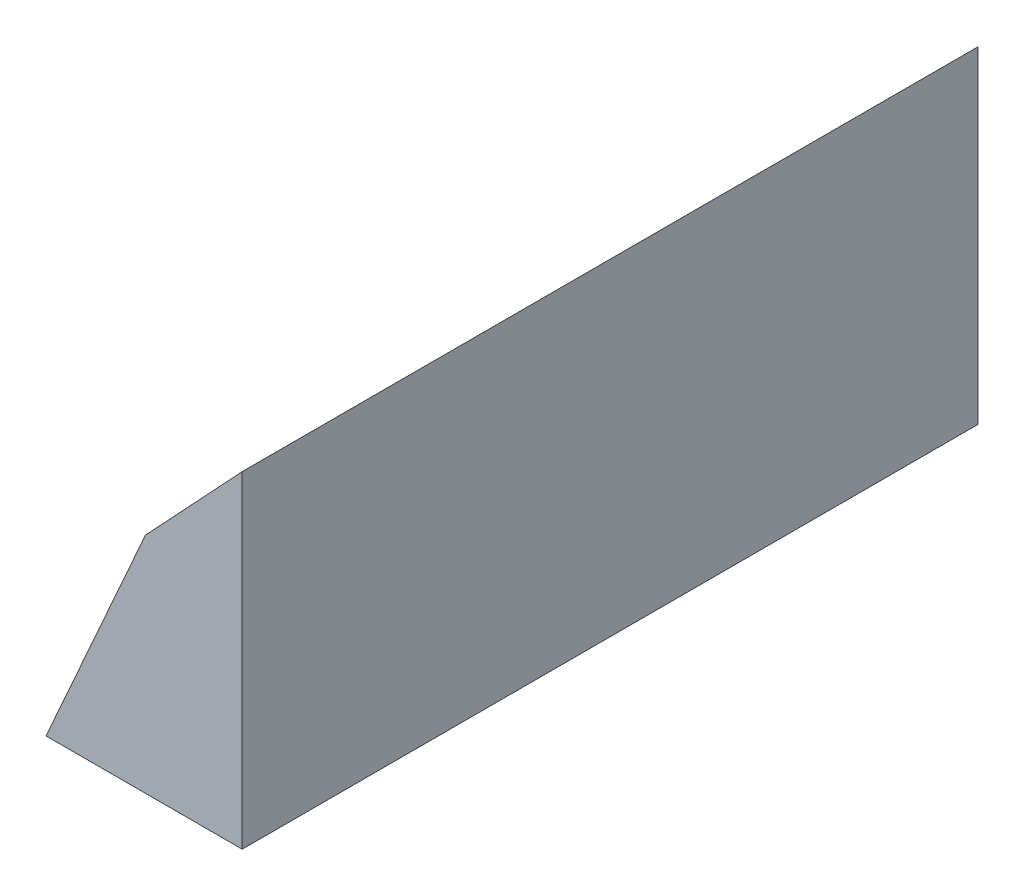
ISO-10303-21;
HEADER;
FILE_DESCRIPTION(('STEP AP214'),'2;1');
FILE_NAME('part.step','',(''),(''),'','','');
FILE_SCHEMA(('AUTOMOTIVE_DESIGN { 1 0 10303 214 1 1 1 1 }'));
ENDSEC;
DATA;
#1=APPLICATION_CONTEXT('core data for automotive mechanical design processes');
#2=APPLICATION_PROTOCOL_DEFINITION('international standard','automotive_design',2000,#1);
#3=PRODUCT_CONTEXT('',#1,'mechanical');
#4=PRODUCT('Part','Part','',(#3));
#5=PRODUCT_RELATED_PRODUCT_CATEGORY('part','',(#4));
#6=PRODUCT_DEFINITION_FORMATION('','',#4);
#7=PRODUCT_DEFINITION_CONTEXT('part definition',#1,'design');
#8=PRODUCT_DEFINITION('design','',#6,#7);
#9=PRODUCT_DEFINITION_SHAPE('','',#8);
#10=(LENGTH_UNIT() NAMED_UNIT(*) SI_UNIT(.MILLI.,.METRE.));
#11=(NAMED_UNIT(*) PLANE_ANGLE_UNIT() SI_UNIT($,.RADIAN.));
#12=(NAMED_UNIT(*) SI_UNIT($,.STERADIAN.) SOLID_ANGLE_UNIT());
#13=UNCERTAINTY_MEASURE_WITH_UNIT(LENGTH_MEASURE(1.E-05),#10,'distance_accuracy_value','');
#14=(GEOMETRIC_REPRESENTATION_CONTEXT(3) GLOBAL_UNCERTAINTY_ASSIGNED_CONTEXT((#13)) GLOBAL_UNIT_ASSIGNED_CONTEXT((#10,
#11,#12)) REPRESENTATION_CONTEXT('',''));
#15=CARTESIAN_POINT('',(0.,0.,0.));
#16=DIRECTION('',(0.,0.,1.));
#17=DIRECTION('',(1.,0.,0.));
#18=AXIS2_PLACEMENT_3D('',#15,#16,#17);
#19=CARTESIAN_POINT('',(-60.,-52.5943396226415,225.));
#20=DIRECTION('',(0.913725457080609,-0.406332116725754,0.));
#21=DIRECTION('',(0.406332116725754,0.913725457080609,0.));
#22=AXIS2_PLACEMENT_3D('',#19,#20,#21);
#23=PLANE('',#22);
#24=DIRECTION('',(0.,0.,-1.));
#25=VECTOR('',#24,1.);
#26=CARTESIAN_POINT('',(-29.5867232253153,15.796476850829,225.));
#27=LINE('',#26,#25);
#28=CARTESIAN_POINT('',(-29.5867232253153,15.796476850829,194.510681987334));
#29=VERTEX_POINT('',#28);
#30=CARTESIAN_POINT('',(-29.5867232253153,15.796476850829,30.4893180126659));
#31=VERTEX_POINT('',#30);
#32=EDGE_CURVE('E95',#29,#31,#27,.T.);
#33=ORIENTED_EDGE('',*,*,#32,.T.);
#34=CARTESIAN_POINT('',(-30.,14.8671348315653,22.5));
#35=DIRECTION('',(0.913725457080609,-0.406332116725754,0.));
#36=DIRECTION('',(-0.406332116725754,-0.913725457080609,0.));
#37=AXIS2_PLACEMENT_3D('',#34,#35,#36);
#38=ELLIPSE('',#37,19.6883280220732,8.);
#39=CARTESIAN_POINT('',(-29.5867232253153,15.796476850829,14.5106819873343));
#40=VERTEX_POINT('',#39);
#41=EDGE_CURVE('E59',#31,#40,#38,.T.);
#42=ORIENTED_EDGE('',*,*,#41,.T.);
#43=CARTESIAN_POINT('',(-29.5867232253153,15.796476850829,0.));
#44=VERTEX_POINT('',#43);
#45=EDGE_CURVE('E102',#40,#44,#27,.T.);
#46=ORIENTED_EDGE('',*,*,#45,.T.);
#47=DIRECTION('',(-0.406332116725754,-0.913725457080609,0.));
#48=VECTOR('',#47,1.);
#49=CARTESIAN_POINT('',(-60.,-52.5943396226415,0.));
#50=LINE('',#49,#48);
#51=CARTESIAN_POINT('',(-60.,-52.5943396226415,0.));
#52=VERTEX_POINT('',#51);
#53=EDGE_CURVE('E189',#44,#52,#50,.T.);
#54=ORIENTED_EDGE('',*,*,#53,.T.);
#55=DIRECTION('',(0.,0.,-1.));
#56=VECTOR('',#55,1.);
#57=CARTESIAN_POINT('',(-60.,-52.5943396226415,225.));
#58=LINE('',#57,#56);
#59=CARTESIAN_POINT('',(-60.,-52.5943396226415,225.));
#60=VERTEX_POINT('',#59);
#61=EDGE_CURVE('E92',#60,#52,#58,.T.);
#62=ORIENTED_EDGE('',*,*,#61,.F.);
#63=DIRECTION('',(-0.406332116725754,-0.913725457080609,0.));
#64=VECTOR('',#63,1.);
#65=CARTESIAN_POINT('',(-60.,-52.5943396226415,225.));
#66=LINE('',#65,#64);
#67=CARTESIAN_POINT('',(-29.5867232253153,15.796476850829,225.));
#68=VERTEX_POINT('',#67);
#69=EDGE_CURVE('E192',#68,#60,#66,.T.);
#70=ORIENTED_EDGE('',*,*,#69,.F.);
#71=CARTESIAN_POINT('',(-29.5867232253153,15.796476850829,210.489318012666));
#72=VERTEX_POINT('',#71);
#73=EDGE_CURVE('E97',#68,#72,#27,.T.);
#74=ORIENTED_EDGE('',*,*,#73,.T.);
#75=CARTESIAN_POINT('',(-30.,14.8671348315653,202.5));
#76=DIRECTION('',(0.913725457080609,-0.406332116725754,0.));
#77=DIRECTION('',(-0.406332116725754,-0.913725457080609,0.));
#78=AXIS2_PLACEMENT_3D('',#75,#76,#77);
#79=ELLIPSE('',#78,19.6883280220732,8.);
#80=EDGE_CURVE('E52',#72,#29,#79,.T.);
#81=ORIENTED_EDGE('',*,*,#80,.T.);
#82=EDGE_LOOP('',(#33,#42,#46,#54,#62,#70,#74,#81));
#83=FACE_BOUND('',#82,.T.);
#84=ADVANCED_FACE('F39',(#83),#23,.F.);
#85=CARTESIAN_POINT('',(-60.,-52.5943396226415,225.));
#86=DIRECTION('',(0.,1.,0.));
#87=DIRECTION('',(0.,0.,1.));
#88=AXIS2_PLACEMENT_3D('',#85,#86,#87);
#89=PLANE('',#88);
#90=CARTESIAN_POINT('',(-30.,-52.5943396226415,202.5));
#91=DIRECTION('',(0.,-1.,0.));
#92=DIRECTION('',(0.,0.,-1.));
#93=AXIS2_PLACEMENT_3D('',#90,#91,#92);
#94=CIRCLE('',#93,4.50000000000001);
#95=CARTESIAN_POINT('',(-30.,-52.5943396226415,198.));
#96=VERTEX_POINT('',#95);
#97=EDGE_CURVE('E186',#96,#96,#94,.T.);
#98=ORIENTED_EDGE('',*,*,#97,.F.);
#99=EDGE_LOOP('',(#98));
#100=FACE_BOUND('',#99,.T.);
#101=CARTESIAN_POINT('',(-30.,-52.5943396226415,22.5));
#102=DIRECTION('',(0.,-1.,0.));
#103=DIRECTION('',(0.,0.,-1.));
#104=AXIS2_PLACEMENT_3D('',#101,#102,#103);
#105=CIRCLE('',#104,4.5);
#106=CARTESIAN_POINT('',(-30.,-52.5943396226415,18.));
#107=VERTEX_POINT('',#106);
#108=EDGE_CURVE('E185',#107,#107,#105,.T.);
#109=ORIENTED_EDGE('',*,*,#108,.F.);
#110=EDGE_LOOP('',(#109));
#111=FACE_BOUND('',#110,.T.);
#112=DIRECTION('',(1.,0.,0.));
#113=VECTOR('',#112,1.);
#114=CARTESIAN_POINT('',(-60.,-52.5943396226415,0.));
#115=LINE('',#114,#113);
#116=CARTESIAN_POINT('',(0.,-52.5943396226415,0.));
#117=VERTEX_POINT('',#116);
#118=EDGE_CURVE('E202',#52,#117,#115,.T.);
#119=ORIENTED_EDGE('',*,*,#118,.T.);
#120=DIRECTION('',(0.,0.,-1.));
#121=VECTOR('',#120,1.);
#122=CARTESIAN_POINT('',(0.,-52.5943396226415,225.));
#123=LINE('',#122,#121);
#124=CARTESIAN_POINT('',(0.,-52.5943396226415,225.));
#125=VERTEX_POINT('',#124);
#126=EDGE_CURVE('E112',#125,#117,#123,.T.);
#127=ORIENTED_EDGE('',*,*,#126,.F.);
#128=DIRECTION('',(1.,0.,0.));
#129=VECTOR('',#128,1.);
#130=CARTESIAN_POINT('',(-60.,-52.5943396226415,225.));
#131=LINE('',#130,#129);
#132=EDGE_CURVE('E195',#60,#125,#131,.T.);
#133=ORIENTED_EDGE('',*,*,#132,.F.);
#134=ORIENTED_EDGE('',*,*,#61,.T.);
#135=EDGE_LOOP('',(#119,#127,#133,#134));
#136=FACE_BOUND('',#135,.T.);
#137=ADVANCED_FACE('F140',(#100,#111,#136),#89,.F.);
#138=CARTESIAN_POINT('',(0.,-52.5943396226415,225.));
#139=DIRECTION('',(-1.,0.,0.));
#140=DIRECTION('',(0.,0.,1.));
#141=AXIS2_PLACEMENT_3D('',#138,#139,#140);
#142=PLANE('',#141);
#143=DIRECTION('',(0.,1.,0.));
#144=VECTOR('',#143,1.);
#145=CARTESIAN_POINT('',(0.,-52.5943396226415,0.));
#146=LINE('',#145,#144);
#147=CARTESIAN_POINT('',(0.,47.4056603773585,0.));
#148=VERTEX_POINT('',#147);
#149=EDGE_CURVE('E203',#117,#148,#146,.T.);
#150=ORIENTED_EDGE('',*,*,#149,.T.);
#151=DIRECTION('',(0.,0.,-1.));
#152=VECTOR('',#151,1.);
#153=CARTESIAN_POINT('',(0.,47.4056603773585,225.));
#154=LINE('',#153,#152);
#155=CARTESIAN_POINT('',(0.,47.4056603773585,225.));
#156=VERTEX_POINT('',#155);
#157=EDGE_CURVE('E104',#156,#148,#154,.T.);
#158=ORIENTED_EDGE('',*,*,#157,.F.);
#159=DIRECTION('',(0.,1.,0.));
#160=VECTOR('',#159,1.);
#161=CARTESIAN_POINT('',(0.,-52.5943396226415,225.));
#162=LINE('',#161,#160);
#163=EDGE_CURVE('E197',#125,#156,#162,.T.);
#164=ORIENTED_EDGE('',*,*,#163,.F.);
#165=ORIENTED_EDGE('',*,*,#126,.T.);
#166=EDGE_LOOP('',(#150,#158,#164,#165));
#167=FACE_BOUND('',#166,.T.);
#168=ADVANCED_FACE('F145',(#167),#142,.F.);
#169=CARTESIAN_POINT('',(-29.5867232253153,15.796476850829,225.));
#170=DIRECTION('',(0.730077317549614,-0.683364551611773,0.));
#171=DIRECTION('',(0.683364551611773,0.730077317549614,0.));
#172=AXIS2_PLACEMENT_3D('',#169,#170,#171);
#173=PLANE('',#172);
#174=ORIENTED_EDGE('',*,*,#45,.F.);
#175=CARTESIAN_POINT('',(-30.,15.3549497064143,22.5));
#176=DIRECTION('',(0.730077317549614,-0.683364551611773,0.));
#177=DIRECTION('',(-0.683364551611773,-0.730077317549614,0.));
#178=AXIS2_PLACEMENT_3D('',#175,#176,#177);
#179=ELLIPSE('',#178,11.7067822454813,8.);
#180=EDGE_CURVE('E11',#40,#31,#179,.T.);
#181=ORIENTED_EDGE('',*,*,#180,.T.);
#182=ORIENTED_EDGE('',*,*,#32,.F.);
#183=CARTESIAN_POINT('',(-30.,15.3549497064143,202.5));
#184=DIRECTION('',(0.730077317549614,-0.683364551611773,0.));
#185=DIRECTION('',(-0.683364551611773,-0.730077317549614,0.));
#186=AXIS2_PLACEMENT_3D('',#183,#184,#185);
#187=ELLIPSE('',#186,11.7067822454813,8.);
#188=EDGE_CURVE('E46',#29,#72,#187,.T.);
#189=ORIENTED_EDGE('',*,*,#188,.T.);
#190=ORIENTED_EDGE('',*,*,#73,.F.);
#191=DIRECTION('',(-0.683364551611773,-0.730077317549614,0.));
#192=VECTOR('',#191,1.);
#193=CARTESIAN_POINT('',(-29.5867232253153,15.796476850829,225.));
#194=LINE('',#193,#192);
#195=EDGE_CURVE('E105',#156,#68,#194,.T.);
#196=ORIENTED_EDGE('',*,*,#195,.F.);
#197=ORIENTED_EDGE('',*,*,#157,.T.);
#198=DIRECTION('',(-0.683364551611773,-0.730077317549614,0.));
#199=VECTOR('',#198,1.);
#200=CARTESIAN_POINT('',(-29.5867232253153,15.796476850829,0.));
#201=LINE('',#200,#199);
#202=EDGE_CURVE('E108',#148,#44,#201,.T.);
#203=ORIENTED_EDGE('',*,*,#202,.T.);
#204=EDGE_LOOP('',(#174,#181,#182,#189,#190,#196,#197,#203));
#205=FACE_BOUND('',#204,.T.);
#206=ADVANCED_FACE('F101',(#205),#173,.F.);
#207=CARTESIAN_POINT('',(0.,0.,225.));
#208=DIRECTION('',(0.,0.,-1.));
#209=DIRECTION('',(-1.,0.,0.));
#210=AXIS2_PLACEMENT_3D('',#207,#208,#209);
#211=PLANE('',#210);
#212=ORIENTED_EDGE('',*,*,#69,.T.);
#213=ORIENTED_EDGE('',*,*,#132,.T.);
#214=ORIENTED_EDGE('',*,*,#163,.T.);
#215=ORIENTED_EDGE('',*,*,#195,.T.);
#216=EDGE_LOOP('',(#212,#213,#214,#215));
#217=FACE_BOUND('',#216,.T.);
#218=ADVANCED_FACE('F157',(#217),#211,.F.);
#219=CARTESIAN_POINT('',(0.,0.,0.));
#220=DIRECTION('',(0.,0.,-1.));
#221=DIRECTION('',(-1.,0.,0.));
#222=AXIS2_PLACEMENT_3D('',#219,#220,#221);
#223=PLANE('',#222);
#224=ORIENTED_EDGE('',*,*,#53,.F.);
#225=ORIENTED_EDGE('',*,*,#202,.F.);
#226=ORIENTED_EDGE('',*,*,#149,.F.);
#227=ORIENTED_EDGE('',*,*,#118,.F.);
#228=EDGE_LOOP('',(#224,#225,#226,#227));
#229=FACE_BOUND('',#228,.T.);
#230=ADVANCED_FACE('F158',(#229),#223,.T.);
#231=CARTESIAN_POINT('',(-30.,47.4056603773585,22.5));
#232=DIRECTION('',(0.,-1.,0.));
#233=DIRECTION('',(0.,0.,-1.));
#234=AXIS2_PLACEMENT_3D('',#231,#232,#233);
#235=CYLINDRICAL_SURFACE('',#234,4.5);
#236=CARTESIAN_POINT('',(-30.,-49.5943396226415,22.5));
#237=DIRECTION('',(0.,-1.,0.));
#238=DIRECTION('',(0.,0.,-1.));
#239=AXIS2_PLACEMENT_3D('',#236,#237,#238);
#240=CIRCLE('',#239,4.5);
#241=CARTESIAN_POINT('',(-30.,-49.5943396226415,18.));
#242=VERTEX_POINT('',#241);
#243=EDGE_CURVE('E98',#242,#242,#240,.F.);
#244=ORIENTED_EDGE('',*,*,#243,.T.);
#245=EDGE_LOOP('',(#244));
#246=FACE_BOUND('',#245,.T.);
#247=ORIENTED_EDGE('',*,*,#108,.T.);
#248=EDGE_LOOP('',(#247));
#249=FACE_BOUND('',#248,.T.);
#250=ADVANCED_FACE('F124',(#246,#249),#235,.F.);
#251=CARTESIAN_POINT('',(-30.,47.4056603773585,202.5));
#252=DIRECTION('',(0.,-1.,0.));
#253=DIRECTION('',(0.,0.,-1.));
#254=AXIS2_PLACEMENT_3D('',#251,#252,#253);
#255=CYLINDRICAL_SURFACE('',#254,4.50000000000001);
#256=CARTESIAN_POINT('',(-30.,-49.5943396226415,202.5));
#257=DIRECTION('',(0.,-1.,0.));
#258=DIRECTION('',(0.,0.,-1.));
#259=AXIS2_PLACEMENT_3D('',#256,#257,#258);
#260=CIRCLE('',#259,4.50000000000001);
#261=CARTESIAN_POINT('',(-30.,-49.5943396226415,198.));
#262=VERTEX_POINT('',#261);
#263=EDGE_CURVE('E117',#262,#262,#260,.F.);
#264=ORIENTED_EDGE('',*,*,#263,.T.);
#265=EDGE_LOOP('',(#264));
#266=FACE_BOUND('',#265,.T.);
#267=ORIENTED_EDGE('',*,*,#97,.T.);
#268=EDGE_LOOP('',(#267));
#269=FACE_BOUND('',#268,.T.);
#270=ADVANCED_FACE('F166',(#266,#269),#255,.F.);
#271=CARTESIAN_POINT('',(-30.,47.4056603773585,202.5));
#272=DIRECTION('',(0.,-1.,0.));
#273=DIRECTION('',(0.,0.,-1.));
#274=AXIS2_PLACEMENT_3D('',#271,#272,#273);
#275=CYLINDRICAL_SURFACE('',#274,8.);
#276=CARTESIAN_POINT('',(-30.,-49.5943396226415,202.5));
#277=DIRECTION('',(0.,-1.,0.));
#278=DIRECTION('',(0.,0.,-1.));
#279=AXIS2_PLACEMENT_3D('',#276,#277,#278);
#280=CIRCLE('',#279,8.);
#281=CARTESIAN_POINT('',(-30.,-49.5943396226415,194.5));
#282=VERTEX_POINT('',#281);
#283=EDGE_CURVE('E179',#282,#282,#280,.T.);
#284=ORIENTED_EDGE('',*,*,#283,.T.);
#285=EDGE_LOOP('',(#284));
#286=FACE_BOUND('',#285,.T.);
#287=ORIENTED_EDGE('',*,*,#188,.F.);
#288=ORIENTED_EDGE('',*,*,#80,.F.);
#289=EDGE_LOOP('',(#287,#288));
#290=FACE_BOUND('',#289,.T.);
#291=ADVANCED_FACE('F87',(#286,#290),#275,.F.);
#292=CARTESIAN_POINT('',(-30.,-49.5943396226415,202.5));
#293=DIRECTION('',(0.,-1.,0.));
#294=DIRECTION('',(0.,0.,-1.));
#295=AXIS2_PLACEMENT_3D('',#292,#293,#294);
#296=PLANE('',#295);
#297=ORIENTED_EDGE('',*,*,#283,.F.);
#298=EDGE_LOOP('',(#297));
#299=FACE_BOUND('',#298,.T.);
#300=ORIENTED_EDGE('',*,*,#263,.F.);
#301=EDGE_LOOP('',(#300));
#302=FACE_BOUND('',#301,.T.);
#303=ADVANCED_FACE('F135',(#299,#302),#296,.F.);
#304=CARTESIAN_POINT('',(-30.,47.4056603773585,22.5));
#305=DIRECTION('',(0.,-1.,0.));
#306=DIRECTION('',(0.,0.,-1.));
#307=AXIS2_PLACEMENT_3D('',#304,#305,#306);
#308=CYLINDRICAL_SURFACE('',#307,8.);
#309=CARTESIAN_POINT('',(-30.,-49.5943396226415,22.5));
#310=DIRECTION('',(0.,-1.,0.));
#311=DIRECTION('',(0.,0.,-1.));
#312=AXIS2_PLACEMENT_3D('',#309,#310,#311);
#313=CIRCLE('',#312,8.);
#314=CARTESIAN_POINT('',(-30.,-49.5943396226415,14.5));
#315=VERTEX_POINT('',#314);
#316=EDGE_CURVE('E120',#315,#315,#313,.T.);
#317=ORIENTED_EDGE('',*,*,#316,.T.);
#318=EDGE_LOOP('',(#317));
#319=FACE_BOUND('',#318,.T.);
#320=ORIENTED_EDGE('',*,*,#180,.F.);
#321=ORIENTED_EDGE('',*,*,#41,.F.);
#322=EDGE_LOOP('',(#320,#321));
#323=FACE_BOUND('',#322,.T.);
#324=ADVANCED_FACE('F129',(#319,#323),#308,.F.);
#325=CARTESIAN_POINT('',(-30.,-49.5943396226415,22.5));
#326=DIRECTION('',(0.,-1.,0.));
#327=DIRECTION('',(0.,0.,-1.));
#328=AXIS2_PLACEMENT_3D('',#325,#326,#327);
#329=PLANE('',#328);
#330=ORIENTED_EDGE('',*,*,#316,.F.);
#331=EDGE_LOOP('',(#330));
#332=FACE_BOUND('',#331,.T.);
#333=ORIENTED_EDGE('',*,*,#243,.F.);
#334=EDGE_LOOP('',(#333));
#335=FACE_BOUND('',#334,.T.);
#336=ADVANCED_FACE('F127',(#332,#335),#329,.F.);
#337=CLOSED_SHELL('',(#84,#137,#168,#206,#218,#230,#250,#270,#291,#303,#324,#336));
#338=MANIFOLD_SOLID_BREP('B2',#337);
#339=ADVANCED_BREP_SHAPE_REPRESENTATION('',(#18,#338),#14);
#340=SHAPE_DEFINITION_REPRESENTATION(#9,#339);
ENDSEC;
END-ISO-10303-21;
